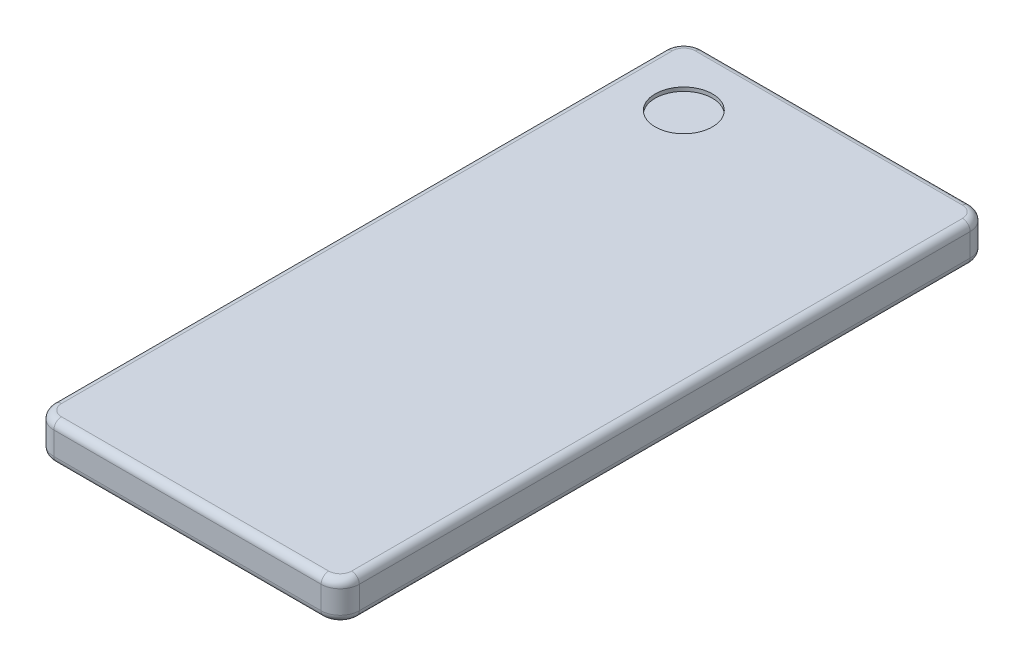
ISO-10303-21;
HEADER;
FILE_DESCRIPTION(('STEP AP214'),'2;1');
FILE_NAME('part.step','',(''),(''),'','','');
FILE_SCHEMA(('AUTOMOTIVE_DESIGN { 1 0 10303 214 1 1 1 1 }'));
ENDSEC;
DATA;
#1=APPLICATION_CONTEXT('core data for automotive mechanical design processes');
#2=APPLICATION_PROTOCOL_DEFINITION('international standard','automotive_design',2000,#1);
#3=PRODUCT_CONTEXT('',#1,'mechanical');
#4=PRODUCT('Part','Part','',(#3));
#5=PRODUCT_RELATED_PRODUCT_CATEGORY('part','',(#4));
#6=PRODUCT_DEFINITION_FORMATION('','',#4);
#7=PRODUCT_DEFINITION_CONTEXT('part definition',#1,'design');
#8=PRODUCT_DEFINITION('design','',#6,#7);
#9=PRODUCT_DEFINITION_SHAPE('','',#8);
#10=(LENGTH_UNIT() NAMED_UNIT(*) SI_UNIT(.MILLI.,.METRE.));
#11=(NAMED_UNIT(*) PLANE_ANGLE_UNIT() SI_UNIT($,.RADIAN.));
#12=(NAMED_UNIT(*) SI_UNIT($,.STERADIAN.) SOLID_ANGLE_UNIT());
#13=UNCERTAINTY_MEASURE_WITH_UNIT(LENGTH_MEASURE(1.E-05),#10,'distance_accuracy_value','');
#14=(GEOMETRIC_REPRESENTATION_CONTEXT(3) GLOBAL_UNCERTAINTY_ASSIGNED_CONTEXT((#13)) GLOBAL_UNIT_ASSIGNED_CONTEXT((#10,
#11,#12)) REPRESENTATION_CONTEXT('',''));
#15=CARTESIAN_POINT('',(0.,0.,0.));
#16=DIRECTION('',(0.,0.,1.));
#17=DIRECTION('',(1.,0.,0.));
#18=AXIS2_PLACEMENT_3D('',#15,#16,#17);
#19=CARTESIAN_POINT('',(40.,10.,-85.));
#20=DIRECTION('',(-1.,0.,0.));
#21=DIRECTION('',(0.,0.,1.));
#22=AXIS2_PLACEMENT_3D('',#19,#20,#21);
#23=PLANE('',#22);
#24=DIRECTION('',(0.,-1.,0.));
#25=VECTOR('',#24,1.);
#26=CARTESIAN_POINT('',(40.,10.,80.));
#27=LINE('',#26,#25);
#28=CARTESIAN_POINT('',(40.,8.,80.));
#29=VERTEX_POINT('',#28);
#30=CARTESIAN_POINT('',(40.,2.,80.));
#31=VERTEX_POINT('',#30);
#32=EDGE_CURVE('E293',#29,#31,#27,.T.);
#33=ORIENTED_EDGE('',*,*,#32,.T.);
#34=DIRECTION('',(0.,0.,-1.));
#35=VECTOR('',#34,1.);
#36=CARTESIAN_POINT('',(40.,2.,-85.));
#37=LINE('',#36,#35);
#38=CARTESIAN_POINT('',(40.,2.,-80.));
#39=VERTEX_POINT('',#38);
#40=EDGE_CURVE('E219',#31,#39,#37,.T.);
#41=ORIENTED_EDGE('',*,*,#40,.T.);
#42=DIRECTION('',(0.,-1.,0.));
#43=VECTOR('',#42,1.);
#44=CARTESIAN_POINT('',(40.,10.,-80.));
#45=LINE('',#44,#43);
#46=CARTESIAN_POINT('',(40.,8.,-80.));
#47=VERTEX_POINT('',#46);
#48=EDGE_CURVE('E304',#39,#47,#45,.F.);
#49=ORIENTED_EDGE('',*,*,#48,.T.);
#50=DIRECTION('',(0.,0.,-1.));
#51=VECTOR('',#50,1.);
#52=CARTESIAN_POINT('',(40.,8.,80.));
#53=LINE('',#52,#51);
#54=EDGE_CURVE('E217',#47,#29,#53,.F.);
#55=ORIENTED_EDGE('',*,*,#54,.T.);
#56=EDGE_LOOP('',(#33,#41,#49,#55));
#57=FACE_BOUND('',#56,.T.);
#58=ADVANCED_FACE('F38',(#57),#23,.F.);
#59=CARTESIAN_POINT('',(-40.,10.,-85.));
#60=DIRECTION('',(0.,0.,1.));
#61=DIRECTION('',(1.,0.,0.));
#62=AXIS2_PLACEMENT_3D('',#59,#60,#61);
#63=PLANE('',#62);
#64=DIRECTION('',(0.,-1.,0.));
#65=VECTOR('',#64,1.);
#66=CARTESIAN_POINT('',(35.,10.,-85.));
#67=LINE('',#66,#65);
#68=CARTESIAN_POINT('',(35.,8.,-85.));
#69=VERTEX_POINT('',#68);
#70=CARTESIAN_POINT('',(35.,2.,-85.));
#71=VERTEX_POINT('',#70);
#72=EDGE_CURVE('E308',#69,#71,#67,.T.);
#73=ORIENTED_EDGE('',*,*,#72,.T.);
#74=DIRECTION('',(-1.,0.,0.));
#75=VECTOR('',#74,1.);
#76=CARTESIAN_POINT('',(-40.,2.,-85.));
#77=LINE('',#76,#75);
#78=CARTESIAN_POINT('',(-35.,2.,-85.));
#79=VERTEX_POINT('',#78);
#80=EDGE_CURVE('E211',#71,#79,#77,.T.);
#81=ORIENTED_EDGE('',*,*,#80,.T.);
#82=DIRECTION('',(0.,-1.,0.));
#83=VECTOR('',#82,1.);
#84=CARTESIAN_POINT('',(-35.,10.,-85.));
#85=LINE('',#84,#83);
#86=CARTESIAN_POINT('',(-35.,8.,-85.));
#87=VERTEX_POINT('',#86);
#88=EDGE_CURVE('E254',#79,#87,#85,.F.);
#89=ORIENTED_EDGE('',*,*,#88,.T.);
#90=DIRECTION('',(-1.,0.,0.));
#91=VECTOR('',#90,1.);
#92=CARTESIAN_POINT('',(35.,8.,-85.));
#93=LINE('',#92,#91);
#94=EDGE_CURVE('E209',#87,#69,#93,.F.);
#95=ORIENTED_EDGE('',*,*,#94,.T.);
#96=EDGE_LOOP('',(#73,#81,#89,#95));
#97=FACE_BOUND('',#96,.T.);
#98=ADVANCED_FACE('F340',(#97),#63,.F.);
#99=CARTESIAN_POINT('',(-40.,10.,-85.));
#100=DIRECTION('',(1.,0.,0.));
#101=DIRECTION('',(0.,0.,-1.));
#102=AXIS2_PLACEMENT_3D('',#99,#100,#101);
#103=PLANE('',#102);
#104=DIRECTION('',(0.,-1.,0.));
#105=VECTOR('',#104,1.);
#106=CARTESIAN_POINT('',(-40.,10.,-80.));
#107=LINE('',#106,#105);
#108=CARTESIAN_POINT('',(-40.,8.,-80.));
#109=VERTEX_POINT('',#108);
#110=CARTESIAN_POINT('',(-40.,2.,-80.));
#111=VERTEX_POINT('',#110);
#112=EDGE_CURVE('E297',#109,#111,#107,.T.);
#113=ORIENTED_EDGE('',*,*,#112,.T.);
#114=DIRECTION('',(0.,0.,1.));
#115=VECTOR('',#114,1.);
#116=CARTESIAN_POINT('',(-40.,2.,-85.));
#117=LINE('',#116,#115);
#118=CARTESIAN_POINT('',(-40.,2.,80.));
#119=VERTEX_POINT('',#118);
#120=EDGE_CURVE('E202',#111,#119,#117,.T.);
#121=ORIENTED_EDGE('',*,*,#120,.T.);
#122=DIRECTION('',(0.,-1.,0.));
#123=VECTOR('',#122,1.);
#124=CARTESIAN_POINT('',(-40.,10.,80.));
#125=LINE('',#124,#123);
#126=CARTESIAN_POINT('',(-40.,8.,80.));
#127=VERTEX_POINT('',#126);
#128=EDGE_CURVE('E299',#119,#127,#125,.F.);
#129=ORIENTED_EDGE('',*,*,#128,.T.);
#130=DIRECTION('',(0.,0.,1.));
#131=VECTOR('',#130,1.);
#132=CARTESIAN_POINT('',(-40.,8.,-80.));
#133=LINE('',#132,#131);
#134=EDGE_CURVE('E200',#127,#109,#133,.F.);
#135=ORIENTED_EDGE('',*,*,#134,.T.);
#136=EDGE_LOOP('',(#113,#121,#129,#135));
#137=FACE_BOUND('',#136,.T.);
#138=ADVANCED_FACE('F337',(#137),#103,.F.);
#139=CARTESIAN_POINT('',(-40.,10.,85.));
#140=DIRECTION('',(0.,0.,-1.));
#141=DIRECTION('',(-1.,0.,0.));
#142=AXIS2_PLACEMENT_3D('',#139,#140,#141);
#143=PLANE('',#142);
#144=DIRECTION('',(0.,-1.,0.));
#145=VECTOR('',#144,1.);
#146=CARTESIAN_POINT('',(35.,10.,85.));
#147=LINE('',#146,#145);
#148=CARTESIAN_POINT('',(35.,2.,85.));
#149=VERTEX_POINT('',#148);
#150=CARTESIAN_POINT('',(35.,8.,85.));
#151=VERTEX_POINT('',#150);
#152=EDGE_CURVE('E180',#149,#151,#147,.F.);
#153=ORIENTED_EDGE('',*,*,#152,.T.);
#154=DIRECTION('',(1.,0.,0.));
#155=VECTOR('',#154,1.);
#156=CARTESIAN_POINT('',(-35.,8.,85.));
#157=LINE('',#156,#155);
#158=CARTESIAN_POINT('',(-35.,8.,85.));
#159=VERTEX_POINT('',#158);
#160=EDGE_CURVE('E11',#151,#159,#157,.F.);
#161=ORIENTED_EDGE('',*,*,#160,.T.);
#162=DIRECTION('',(0.,-1.,0.));
#163=VECTOR('',#162,1.);
#164=CARTESIAN_POINT('',(-35.,10.,85.));
#165=LINE('',#164,#163);
#166=CARTESIAN_POINT('',(-35.,2.,85.));
#167=VERTEX_POINT('',#166);
#168=EDGE_CURVE('E177',#159,#167,#165,.T.);
#169=ORIENTED_EDGE('',*,*,#168,.T.);
#170=DIRECTION('',(1.,0.,0.));
#171=VECTOR('',#170,1.);
#172=CARTESIAN_POINT('',(-40.,2.,85.));
#173=LINE('',#172,#171);
#174=EDGE_CURVE('E47',#167,#149,#173,.T.);
#175=ORIENTED_EDGE('',*,*,#174,.T.);
#176=EDGE_LOOP('',(#153,#161,#169,#175));
#177=FACE_BOUND('',#176,.T.);
#178=ADVANCED_FACE('F295',(#177),#143,.F.);
#179=CARTESIAN_POINT('',(0.,10.,0.));
#180=DIRECTION('',(0.,1.,0.));
#181=DIRECTION('',(0.,0.,1.));
#182=AXIS2_PLACEMENT_3D('',#179,#180,#181);
#183=PLANE('',#182);
#184=CARTESIAN_POINT('',(-23.,10.,-68.));
#185=DIRECTION('',(0.,1.,0.));
#186=DIRECTION('',(0.,0.,1.));
#187=AXIS2_PLACEMENT_3D('',#184,#185,#186);
#188=CIRCLE('',#187,7.5);
#189=CARTESIAN_POINT('',(-23.,10.,-60.5));
#190=VERTEX_POINT('',#189);
#191=EDGE_CURVE('E313',#190,#190,#188,.T.);
#192=ORIENTED_EDGE('',*,*,#191,.F.);
#193=EDGE_LOOP('',(#192));
#194=FACE_BOUND('',#193,.T.);
#195=DIRECTION('',(-1.,0.,0.));
#196=VECTOR('',#195,1.);
#197=CARTESIAN_POINT('',(-35.,10.,-83.));
#198=LINE('',#197,#196);
#199=CARTESIAN_POINT('',(35.,10.,-83.));
#200=VERTEX_POINT('',#199);
#201=CARTESIAN_POINT('',(-35.,10.,-83.));
#202=VERTEX_POINT('',#201);
#203=EDGE_CURVE('E55',#200,#202,#198,.T.);
#204=ORIENTED_EDGE('',*,*,#203,.T.);
#205=CARTESIAN_POINT('',(-35.,10.,-80.));
#206=DIRECTION('',(0.,1.,0.));
#207=DIRECTION('',(0.,0.,1.));
#208=AXIS2_PLACEMENT_3D('',#205,#206,#207);
#209=CIRCLE('',#208,3.);
#210=CARTESIAN_POINT('',(-38.,10.,-80.));
#211=VERTEX_POINT('',#210);
#212=EDGE_CURVE('E236',#202,#211,#209,.T.);
#213=ORIENTED_EDGE('',*,*,#212,.T.);
#214=DIRECTION('',(0.,0.,1.));
#215=VECTOR('',#214,1.);
#216=CARTESIAN_POINT('',(-38.,10.,80.));
#217=LINE('',#216,#215);
#218=CARTESIAN_POINT('',(-38.,10.,80.));
#219=VERTEX_POINT('',#218);
#220=EDGE_CURVE('E224',#211,#219,#217,.T.);
#221=ORIENTED_EDGE('',*,*,#220,.T.);
#222=CARTESIAN_POINT('',(-35.,10.,80.));
#223=DIRECTION('',(0.,1.,0.));
#224=DIRECTION('',(0.,0.,1.));
#225=AXIS2_PLACEMENT_3D('',#222,#223,#224);
#226=CIRCLE('',#225,3.);
#227=CARTESIAN_POINT('',(-35.,10.,83.));
#228=VERTEX_POINT('',#227);
#229=EDGE_CURVE('E226',#219,#228,#226,.T.);
#230=ORIENTED_EDGE('',*,*,#229,.T.);
#231=DIRECTION('',(1.,0.,0.));
#232=VECTOR('',#231,1.);
#233=CARTESIAN_POINT('',(35.,10.,83.));
#234=LINE('',#233,#232);
#235=CARTESIAN_POINT('',(35.,10.,83.));
#236=VERTEX_POINT('',#235);
#237=EDGE_CURVE('E228',#228,#236,#234,.T.);
#238=ORIENTED_EDGE('',*,*,#237,.T.);
#239=CARTESIAN_POINT('',(35.,10.,80.));
#240=DIRECTION('',(0.,1.,0.));
#241=DIRECTION('',(0.,0.,1.));
#242=AXIS2_PLACEMENT_3D('',#239,#240,#241);
#243=CIRCLE('',#242,3.);
#244=CARTESIAN_POINT('',(38.,10.,80.));
#245=VERTEX_POINT('',#244);
#246=EDGE_CURVE('E230',#236,#245,#243,.T.);
#247=ORIENTED_EDGE('',*,*,#246,.T.);
#248=DIRECTION('',(0.,0.,-1.));
#249=VECTOR('',#248,1.);
#250=CARTESIAN_POINT('',(38.,10.,-80.));
#251=LINE('',#250,#249);
#252=CARTESIAN_POINT('',(38.,10.,-80.));
#253=VERTEX_POINT('',#252);
#254=EDGE_CURVE('E232',#245,#253,#251,.T.);
#255=ORIENTED_EDGE('',*,*,#254,.T.);
#256=CARTESIAN_POINT('',(35.,10.,-80.));
#257=DIRECTION('',(0.,1.,0.));
#258=DIRECTION('',(0.,0.,1.));
#259=AXIS2_PLACEMENT_3D('',#256,#257,#258);
#260=CIRCLE('',#259,3.);
#261=EDGE_CURVE('E60',#253,#200,#260,.T.);
#262=ORIENTED_EDGE('',*,*,#261,.T.);
#263=EDGE_LOOP('',(#204,#213,#221,#230,#238,#247,#255,#262));
#264=FACE_BOUND('',#263,.T.);
#265=ADVANCED_FACE('F328',(#194,#264),#183,.T.);
#266=CARTESIAN_POINT('',(0.,0.,0.));
#267=DIRECTION('',(0.,1.,0.));
#268=DIRECTION('',(0.,0.,1.));
#269=AXIS2_PLACEMENT_3D('',#266,#267,#268);
#270=PLANE('',#269);
#271=DIRECTION('',(1.,0.,0.));
#272=VECTOR('',#271,1.);
#273=CARTESIAN_POINT('',(0.,0.,83.));
#274=LINE('',#273,#272);
#275=CARTESIAN_POINT('',(35.,0.,83.));
#276=VERTEX_POINT('',#275);
#277=CARTESIAN_POINT('',(-35.,0.,83.));
#278=VERTEX_POINT('',#277);
#279=EDGE_CURVE('E156',#276,#278,#274,.F.);
#280=ORIENTED_EDGE('',*,*,#279,.T.);
#281=CARTESIAN_POINT('',(-35.,0.,80.));
#282=DIRECTION('',(0.,1.,0.));
#283=DIRECTION('',(0.,0.,1.));
#284=AXIS2_PLACEMENT_3D('',#281,#282,#283);
#285=CIRCLE('',#284,3.);
#286=CARTESIAN_POINT('',(-38.,0.,80.));
#287=VERTEX_POINT('',#286);
#288=EDGE_CURVE('E193',#278,#287,#285,.F.);
#289=ORIENTED_EDGE('',*,*,#288,.T.);
#290=DIRECTION('',(0.,0.,1.));
#291=VECTOR('',#290,1.);
#292=CARTESIAN_POINT('',(-38.,0.,0.));
#293=LINE('',#292,#291);
#294=CARTESIAN_POINT('',(-38.,0.,-80.));
#295=VERTEX_POINT('',#294);
#296=EDGE_CURVE('E191',#287,#295,#293,.F.);
#297=ORIENTED_EDGE('',*,*,#296,.T.);
#298=CARTESIAN_POINT('',(-35.,0.,-80.));
#299=DIRECTION('',(0.,1.,0.));
#300=DIRECTION('',(0.,0.,1.));
#301=AXIS2_PLACEMENT_3D('',#298,#299,#300);
#302=CIRCLE('',#301,3.);
#303=CARTESIAN_POINT('',(-35.,0.,-83.));
#304=VERTEX_POINT('',#303);
#305=EDGE_CURVE('E189',#295,#304,#302,.F.);
#306=ORIENTED_EDGE('',*,*,#305,.T.);
#307=DIRECTION('',(-1.,0.,0.));
#308=VECTOR('',#307,1.);
#309=CARTESIAN_POINT('',(0.,0.,-83.));
#310=LINE('',#309,#308);
#311=CARTESIAN_POINT('',(35.,0.,-83.));
#312=VERTEX_POINT('',#311);
#313=EDGE_CURVE('E187',#304,#312,#310,.F.);
#314=ORIENTED_EDGE('',*,*,#313,.T.);
#315=CARTESIAN_POINT('',(35.,0.,-80.));
#316=DIRECTION('',(0.,1.,0.));
#317=DIRECTION('',(0.,0.,1.));
#318=AXIS2_PLACEMENT_3D('',#315,#316,#317);
#319=CIRCLE('',#318,3.);
#320=CARTESIAN_POINT('',(38.,0.,-80.));
#321=VERTEX_POINT('',#320);
#322=EDGE_CURVE('E185',#312,#321,#319,.F.);
#323=ORIENTED_EDGE('',*,*,#322,.T.);
#324=DIRECTION('',(0.,0.,-1.));
#325=VECTOR('',#324,1.);
#326=CARTESIAN_POINT('',(38.,0.,0.));
#327=LINE('',#326,#325);
#328=CARTESIAN_POINT('',(38.,0.,80.));
#329=VERTEX_POINT('',#328);
#330=EDGE_CURVE('E159',#321,#329,#327,.F.);
#331=ORIENTED_EDGE('',*,*,#330,.T.);
#332=CARTESIAN_POINT('',(35.,0.,80.));
#333=DIRECTION('',(0.,1.,0.));
#334=DIRECTION('',(0.,0.,1.));
#335=AXIS2_PLACEMENT_3D('',#332,#333,#334);
#336=CIRCLE('',#335,3.);
#337=EDGE_CURVE('E151',#329,#276,#336,.F.);
#338=ORIENTED_EDGE('',*,*,#337,.T.);
#339=EDGE_LOOP('',(#280,#289,#297,#306,#314,#323,#331,#338));
#340=FACE_BOUND('',#339,.T.);
#341=ADVANCED_FACE('F153',(#340),#270,.F.);
#342=CARTESIAN_POINT('',(35.,10.,-80.));
#343=DIRECTION('',(0.,-1.,0.));
#344=DIRECTION('',(0.,0.,-1.));
#345=AXIS2_PLACEMENT_3D('',#342,#343,#344);
#346=CYLINDRICAL_SURFACE('',#345,5.);
#347=ORIENTED_EDGE('',*,*,#48,.F.);
#348=CARTESIAN_POINT('',(35.,2.,-80.));
#349=DIRECTION('',(0.,1.,0.));
#350=DIRECTION('',(0.,0.,1.));
#351=AXIS2_PLACEMENT_3D('',#348,#349,#350);
#352=CIRCLE('',#351,5.);
#353=EDGE_CURVE('E215',#39,#71,#352,.T.);
#354=ORIENTED_EDGE('',*,*,#353,.T.);
#355=ORIENTED_EDGE('',*,*,#72,.F.);
#356=CARTESIAN_POINT('',(35.,8.,-80.));
#357=DIRECTION('',(0.,1.,0.));
#358=DIRECTION('',(0.,0.,1.));
#359=AXIS2_PLACEMENT_3D('',#356,#357,#358);
#360=CIRCLE('',#359,5.);
#361=EDGE_CURVE('E213',#69,#47,#360,.F.);
#362=ORIENTED_EDGE('',*,*,#361,.T.);
#363=EDGE_LOOP('',(#347,#354,#355,#362));
#364=FACE_BOUND('',#363,.T.);
#365=ADVANCED_FACE('F335',(#364),#346,.T.);
#366=CARTESIAN_POINT('',(-35.,10.,-80.));
#367=DIRECTION('',(0.,-1.,0.));
#368=DIRECTION('',(0.,0.,-1.));
#369=AXIS2_PLACEMENT_3D('',#366,#367,#368);
#370=CYLINDRICAL_SURFACE('',#369,5.);
#371=ORIENTED_EDGE('',*,*,#88,.F.);
#372=CARTESIAN_POINT('',(-35.,2.,-80.));
#373=DIRECTION('',(0.,1.,0.));
#374=DIRECTION('',(0.,0.,1.));
#375=AXIS2_PLACEMENT_3D('',#372,#373,#374);
#376=CIRCLE('',#375,5.);
#377=EDGE_CURVE('E207',#79,#111,#376,.T.);
#378=ORIENTED_EDGE('',*,*,#377,.T.);
#379=ORIENTED_EDGE('',*,*,#112,.F.);
#380=CARTESIAN_POINT('',(-35.,8.,-80.));
#381=DIRECTION('',(0.,1.,0.));
#382=DIRECTION('',(0.,0.,1.));
#383=AXIS2_PLACEMENT_3D('',#380,#381,#382);
#384=CIRCLE('',#383,5.);
#385=EDGE_CURVE('E204',#109,#87,#384,.F.);
#386=ORIENTED_EDGE('',*,*,#385,.T.);
#387=EDGE_LOOP('',(#371,#378,#379,#386));
#388=FACE_BOUND('',#387,.T.);
#389=ADVANCED_FACE('F352',(#388),#370,.T.);
#390=CARTESIAN_POINT('',(-35.,10.,80.));
#391=DIRECTION('',(0.,-1.,0.));
#392=DIRECTION('',(0.,0.,-1.));
#393=AXIS2_PLACEMENT_3D('',#390,#391,#392);
#394=CYLINDRICAL_SURFACE('',#393,5.);
#395=ORIENTED_EDGE('',*,*,#128,.F.);
#396=CARTESIAN_POINT('',(-35.,2.,80.));
#397=DIRECTION('',(0.,1.,0.));
#398=DIRECTION('',(0.,0.,1.));
#399=AXIS2_PLACEMENT_3D('',#396,#397,#398);
#400=CIRCLE('',#399,5.);
#401=EDGE_CURVE('E197',#119,#167,#400,.T.);
#402=ORIENTED_EDGE('',*,*,#401,.T.);
#403=ORIENTED_EDGE('',*,*,#168,.F.);
#404=CARTESIAN_POINT('',(-35.,8.,80.));
#405=DIRECTION('',(0.,1.,0.));
#406=DIRECTION('',(0.,0.,1.));
#407=AXIS2_PLACEMENT_3D('',#404,#405,#406);
#408=CIRCLE('',#407,5.);
#409=EDGE_CURVE('E195',#159,#127,#408,.F.);
#410=ORIENTED_EDGE('',*,*,#409,.T.);
#411=EDGE_LOOP('',(#395,#402,#403,#410));
#412=FACE_BOUND('',#411,.T.);
#413=ADVANCED_FACE('F356',(#412),#394,.T.);
#414=CARTESIAN_POINT('',(35.,10.,80.));
#415=DIRECTION('',(0.,-1.,0.));
#416=DIRECTION('',(0.,0.,-1.));
#417=AXIS2_PLACEMENT_3D('',#414,#415,#416);
#418=CYLINDRICAL_SURFACE('',#417,5.);
#419=ORIENTED_EDGE('',*,*,#152,.F.);
#420=CARTESIAN_POINT('',(35.,2.,80.));
#421=DIRECTION('',(0.,1.,0.));
#422=DIRECTION('',(0.,0.,1.));
#423=AXIS2_PLACEMENT_3D('',#420,#421,#422);
#424=CIRCLE('',#423,5.);
#425=EDGE_CURVE('E168',#149,#31,#424,.T.);
#426=ORIENTED_EDGE('',*,*,#425,.T.);
#427=ORIENTED_EDGE('',*,*,#32,.F.);
#428=CARTESIAN_POINT('',(35.,8.,80.));
#429=DIRECTION('',(0.,1.,0.));
#430=DIRECTION('',(0.,0.,1.));
#431=AXIS2_PLACEMENT_3D('',#428,#429,#430);
#432=CIRCLE('',#431,5.);
#433=EDGE_CURVE('E221',#29,#151,#432,.F.);
#434=ORIENTED_EDGE('',*,*,#433,.T.);
#435=EDGE_LOOP('',(#419,#426,#427,#434));
#436=FACE_BOUND('',#435,.T.);
#437=ADVANCED_FACE('F291',(#436),#418,.T.);
#438=CARTESIAN_POINT('',(35.,2.,-80.));
#439=DIRECTION('',(0.,1.,0.));
#440=DIRECTION('',(0.,0.,1.));
#441=AXIS2_PLACEMENT_3D('',#438,#439,#440);
#442=TOROIDAL_SURFACE('',#441,3.,2.);
#443=CARTESIAN_POINT('',(35.,2.,-83.));
#444=DIRECTION('',(-1.,0.,0.));
#445=DIRECTION('',(0.,0.,1.));
#446=AXIS2_PLACEMENT_3D('',#443,#444,#445);
#447=CIRCLE('',#446,2.);
#448=EDGE_CURVE('E248',#71,#312,#447,.T.);
#449=ORIENTED_EDGE('',*,*,#448,.F.);
#450=ORIENTED_EDGE('',*,*,#353,.F.);
#451=CARTESIAN_POINT('',(38.,2.,-80.));
#452=DIRECTION('',(0.,0.,1.));
#453=DIRECTION('',(1.,0.,0.));
#454=AXIS2_PLACEMENT_3D('',#451,#452,#453);
#455=CIRCLE('',#454,2.);
#456=EDGE_CURVE('E251',#321,#39,#455,.T.);
#457=ORIENTED_EDGE('',*,*,#456,.F.);
#458=ORIENTED_EDGE('',*,*,#322,.F.);
#459=EDGE_LOOP('',(#449,#450,#457,#458));
#460=FACE_BOUND('',#459,.T.);
#461=ADVANCED_FACE('F363',(#460),#442,.T.);
#462=CARTESIAN_POINT('',(38.,2.,-85.));
#463=DIRECTION('',(0.,0.,-1.));
#464=DIRECTION('',(-1.,0.,0.));
#465=AXIS2_PLACEMENT_3D('',#462,#463,#464);
#466=CYLINDRICAL_SURFACE('',#465,2.);
#467=ORIENTED_EDGE('',*,*,#456,.T.);
#468=ORIENTED_EDGE('',*,*,#40,.F.);
#469=CARTESIAN_POINT('',(38.,2.,80.));
#470=DIRECTION('',(0.,0.,1.));
#471=DIRECTION('',(1.,0.,0.));
#472=AXIS2_PLACEMENT_3D('',#469,#470,#471);
#473=CIRCLE('',#472,2.);
#474=EDGE_CURVE('E246',#329,#31,#473,.T.);
#475=ORIENTED_EDGE('',*,*,#474,.F.);
#476=ORIENTED_EDGE('',*,*,#330,.F.);
#477=EDGE_LOOP('',(#467,#468,#475,#476));
#478=FACE_BOUND('',#477,.T.);
#479=ADVANCED_FACE('F383',(#478),#466,.T.);
#480=CARTESIAN_POINT('',(-40.,2.,-83.));
#481=DIRECTION('',(-1.,0.,0.));
#482=DIRECTION('',(0.,0.,1.));
#483=AXIS2_PLACEMENT_3D('',#480,#481,#482);
#484=CYLINDRICAL_SURFACE('',#483,2.);
#485=ORIENTED_EDGE('',*,*,#448,.T.);
#486=ORIENTED_EDGE('',*,*,#313,.F.);
#487=CARTESIAN_POINT('',(-35.,2.,-83.));
#488=DIRECTION('',(-1.,0.,0.));
#489=DIRECTION('',(0.,0.,1.));
#490=AXIS2_PLACEMENT_3D('',#487,#488,#489);
#491=CIRCLE('',#490,2.);
#492=EDGE_CURVE('E171',#79,#304,#491,.T.);
#493=ORIENTED_EDGE('',*,*,#492,.F.);
#494=ORIENTED_EDGE('',*,*,#80,.F.);
#495=EDGE_LOOP('',(#485,#486,#493,#494));
#496=FACE_BOUND('',#495,.T.);
#497=ADVANCED_FACE('F380',(#496),#484,.T.);
#498=CARTESIAN_POINT('',(35.,2.,80.));
#499=DIRECTION('',(0.,1.,0.));
#500=DIRECTION('',(0.,0.,1.));
#501=AXIS2_PLACEMENT_3D('',#498,#499,#500);
#502=TOROIDAL_SURFACE('',#501,3.,2.);
#503=ORIENTED_EDGE('',*,*,#474,.T.);
#504=ORIENTED_EDGE('',*,*,#425,.F.);
#505=CARTESIAN_POINT('',(35.,2.,83.));
#506=DIRECTION('',(-1.,0.,0.));
#507=DIRECTION('',(0.,0.,1.));
#508=AXIS2_PLACEMENT_3D('',#505,#506,#507);
#509=CIRCLE('',#508,2.);
#510=EDGE_CURVE('E166',#276,#149,#509,.T.);
#511=ORIENTED_EDGE('',*,*,#510,.F.);
#512=ORIENTED_EDGE('',*,*,#337,.F.);
#513=EDGE_LOOP('',(#503,#504,#511,#512));
#514=FACE_BOUND('',#513,.T.);
#515=ADVANCED_FACE('F167',(#514),#502,.T.);
#516=CARTESIAN_POINT('',(-35.,2.,-80.));
#517=DIRECTION('',(0.,1.,0.));
#518=DIRECTION('',(0.,0.,1.));
#519=AXIS2_PLACEMENT_3D('',#516,#517,#518);
#520=TOROIDAL_SURFACE('',#519,3.,2.);
#521=ORIENTED_EDGE('',*,*,#492,.T.);
#522=ORIENTED_EDGE('',*,*,#305,.F.);
#523=CARTESIAN_POINT('',(-38.,2.,-80.));
#524=DIRECTION('',(0.,0.,1.));
#525=DIRECTION('',(1.,0.,0.));
#526=AXIS2_PLACEMENT_3D('',#523,#524,#525);
#527=CIRCLE('',#526,2.);
#528=EDGE_CURVE('E172',#111,#295,#527,.T.);
#529=ORIENTED_EDGE('',*,*,#528,.F.);
#530=ORIENTED_EDGE('',*,*,#377,.F.);
#531=EDGE_LOOP('',(#521,#522,#529,#530));
#532=FACE_BOUND('',#531,.T.);
#533=ADVANCED_FACE('F374',(#532),#520,.T.);
#534=CARTESIAN_POINT('',(-40.,2.,83.));
#535=DIRECTION('',(1.,0.,0.));
#536=DIRECTION('',(0.,0.,-1.));
#537=AXIS2_PLACEMENT_3D('',#534,#535,#536);
#538=CYLINDRICAL_SURFACE('',#537,2.);
#539=ORIENTED_EDGE('',*,*,#510,.T.);
#540=ORIENTED_EDGE('',*,*,#174,.F.);
#541=CARTESIAN_POINT('',(-35.,2.,83.));
#542=DIRECTION('',(-1.,0.,0.));
#543=DIRECTION('',(0.,0.,1.));
#544=AXIS2_PLACEMENT_3D('',#541,#542,#543);
#545=CIRCLE('',#544,2.);
#546=EDGE_CURVE('E175',#278,#167,#545,.T.);
#547=ORIENTED_EDGE('',*,*,#546,.F.);
#548=ORIENTED_EDGE('',*,*,#279,.F.);
#549=EDGE_LOOP('',(#539,#540,#547,#548));
#550=FACE_BOUND('',#549,.T.);
#551=ADVANCED_FACE('F174',(#550),#538,.T.);
#552=CARTESIAN_POINT('',(-38.,2.,-85.));
#553=DIRECTION('',(0.,0.,1.));
#554=DIRECTION('',(1.,0.,0.));
#555=AXIS2_PLACEMENT_3D('',#552,#553,#554);
#556=CYLINDRICAL_SURFACE('',#555,2.);
#557=ORIENTED_EDGE('',*,*,#528,.T.);
#558=ORIENTED_EDGE('',*,*,#296,.F.);
#559=CARTESIAN_POINT('',(-38.,2.,80.));
#560=DIRECTION('',(0.,0.,1.));
#561=DIRECTION('',(1.,0.,0.));
#562=AXIS2_PLACEMENT_3D('',#559,#560,#561);
#563=CIRCLE('',#562,2.);
#564=EDGE_CURVE('E239',#119,#287,#563,.T.);
#565=ORIENTED_EDGE('',*,*,#564,.F.);
#566=ORIENTED_EDGE('',*,*,#120,.F.);
#567=EDGE_LOOP('',(#557,#558,#565,#566));
#568=FACE_BOUND('',#567,.T.);
#569=ADVANCED_FACE('F367',(#568),#556,.T.);
#570=CARTESIAN_POINT('',(-35.,2.,80.));
#571=DIRECTION('',(0.,1.,0.));
#572=DIRECTION('',(0.,0.,1.));
#573=AXIS2_PLACEMENT_3D('',#570,#571,#572);
#574=TOROIDAL_SURFACE('',#573,3.,2.);
#575=ORIENTED_EDGE('',*,*,#546,.T.);
#576=ORIENTED_EDGE('',*,*,#401,.F.);
#577=ORIENTED_EDGE('',*,*,#564,.T.);
#578=ORIENTED_EDGE('',*,*,#288,.F.);
#579=EDGE_LOOP('',(#575,#576,#577,#578));
#580=FACE_BOUND('',#579,.T.);
#581=ADVANCED_FACE('F364',(#580),#574,.T.);
#582=CARTESIAN_POINT('',(35.,8.,80.));
#583=DIRECTION('',(0.,1.,0.));
#584=DIRECTION('',(0.,0.,1.));
#585=AXIS2_PLACEMENT_3D('',#582,#583,#584);
#586=TOROIDAL_SURFACE('',#585,3.,2.);
#587=CARTESIAN_POINT('',(35.,8.,83.));
#588=DIRECTION('',(-1.,0.,0.));
#589=DIRECTION('',(0.,0.,1.));
#590=AXIS2_PLACEMENT_3D('',#587,#588,#589);
#591=CIRCLE('',#590,2.);
#592=EDGE_CURVE('E271',#151,#236,#591,.T.);
#593=ORIENTED_EDGE('',*,*,#592,.F.);
#594=ORIENTED_EDGE('',*,*,#433,.F.);
#595=CARTESIAN_POINT('',(38.,8.,80.));
#596=DIRECTION('',(0.,0.,-1.));
#597=DIRECTION('',(-1.,0.,0.));
#598=AXIS2_PLACEMENT_3D('',#595,#596,#597);
#599=CIRCLE('',#598,2.);
#600=EDGE_CURVE('E42',#245,#29,#599,.T.);
#601=ORIENTED_EDGE('',*,*,#600,.F.);
#602=ORIENTED_EDGE('',*,*,#246,.F.);
#603=EDGE_LOOP('',(#593,#594,#601,#602));
#604=FACE_BOUND('',#603,.T.);
#605=ADVANCED_FACE('F40',(#604),#586,.T.);
#606=CARTESIAN_POINT('',(38.,8.,0.));
#607=DIRECTION('',(0.,0.,1.));
#608=DIRECTION('',(1.,0.,0.));
#609=AXIS2_PLACEMENT_3D('',#606,#607,#608);
#610=CYLINDRICAL_SURFACE('',#609,2.);
#611=ORIENTED_EDGE('',*,*,#600,.T.);
#612=ORIENTED_EDGE('',*,*,#54,.F.);
#613=CARTESIAN_POINT('',(38.,8.,-80.));
#614=DIRECTION('',(0.,0.,-1.));
#615=DIRECTION('',(-1.,0.,0.));
#616=AXIS2_PLACEMENT_3D('',#613,#614,#615);
#617=CIRCLE('',#616,2.);
#618=EDGE_CURVE('E269',#253,#47,#617,.T.);
#619=ORIENTED_EDGE('',*,*,#618,.F.);
#620=ORIENTED_EDGE('',*,*,#254,.F.);
#621=EDGE_LOOP('',(#611,#612,#619,#620));
#622=FACE_BOUND('',#621,.T.);
#623=ADVANCED_FACE('F282',(#622),#610,.T.);
#624=CARTESIAN_POINT('',(0.,8.,83.));
#625=DIRECTION('',(-1.,0.,0.));
#626=DIRECTION('',(0.,0.,1.));
#627=AXIS2_PLACEMENT_3D('',#624,#625,#626);
#628=CYLINDRICAL_SURFACE('',#627,2.);
#629=ORIENTED_EDGE('',*,*,#592,.T.);
#630=ORIENTED_EDGE('',*,*,#237,.F.);
#631=CARTESIAN_POINT('',(-35.,8.,83.));
#632=DIRECTION('',(-1.,0.,0.));
#633=DIRECTION('',(0.,0.,1.));
#634=AXIS2_PLACEMENT_3D('',#631,#632,#633);
#635=CIRCLE('',#634,2.);
#636=EDGE_CURVE('E266',#159,#228,#635,.T.);
#637=ORIENTED_EDGE('',*,*,#636,.F.);
#638=ORIENTED_EDGE('',*,*,#160,.F.);
#639=EDGE_LOOP('',(#629,#630,#637,#638));
#640=FACE_BOUND('',#639,.T.);
#641=ADVANCED_FACE('F409',(#640),#628,.T.);
#642=CARTESIAN_POINT('',(35.,8.,-80.));
#643=DIRECTION('',(0.,1.,0.));
#644=DIRECTION('',(0.,0.,1.));
#645=AXIS2_PLACEMENT_3D('',#642,#643,#644);
#646=TOROIDAL_SURFACE('',#645,3.,2.);
#647=ORIENTED_EDGE('',*,*,#618,.T.);
#648=ORIENTED_EDGE('',*,*,#361,.F.);
#649=CARTESIAN_POINT('',(35.,8.,-83.));
#650=DIRECTION('',(-1.,0.,0.));
#651=DIRECTION('',(0.,0.,1.));
#652=AXIS2_PLACEMENT_3D('',#649,#650,#651);
#653=CIRCLE('',#652,2.);
#654=EDGE_CURVE('E263',#200,#69,#653,.T.);
#655=ORIENTED_EDGE('',*,*,#654,.F.);
#656=ORIENTED_EDGE('',*,*,#261,.F.);
#657=EDGE_LOOP('',(#647,#648,#655,#656));
#658=FACE_BOUND('',#657,.T.);
#659=ADVANCED_FACE('F405',(#658),#646,.T.);
#660=CARTESIAN_POINT('',(-35.,8.,80.));
#661=DIRECTION('',(0.,1.,0.));
#662=DIRECTION('',(0.,0.,1.));
#663=AXIS2_PLACEMENT_3D('',#660,#661,#662);
#664=TOROIDAL_SURFACE('',#663,3.,2.);
#665=ORIENTED_EDGE('',*,*,#636,.T.);
#666=ORIENTED_EDGE('',*,*,#229,.F.);
#667=CARTESIAN_POINT('',(-38.,8.,80.));
#668=DIRECTION('',(0.,0.,-1.));
#669=DIRECTION('',(-1.,0.,0.));
#670=AXIS2_PLACEMENT_3D('',#667,#668,#669);
#671=CIRCLE('',#670,2.);
#672=EDGE_CURVE('E260',#127,#219,#671,.T.);
#673=ORIENTED_EDGE('',*,*,#672,.F.);
#674=ORIENTED_EDGE('',*,*,#409,.F.);
#675=EDGE_LOOP('',(#665,#666,#673,#674));
#676=FACE_BOUND('',#675,.T.);
#677=ADVANCED_FACE('F401',(#676),#664,.T.);
#678=CARTESIAN_POINT('',(0.,8.,-83.));
#679=DIRECTION('',(1.,0.,0.));
#680=DIRECTION('',(0.,0.,-1.));
#681=AXIS2_PLACEMENT_3D('',#678,#679,#680);
#682=CYLINDRICAL_SURFACE('',#681,2.);
#683=ORIENTED_EDGE('',*,*,#654,.T.);
#684=ORIENTED_EDGE('',*,*,#94,.F.);
#685=CARTESIAN_POINT('',(-35.,8.,-83.));
#686=DIRECTION('',(-1.,0.,0.));
#687=DIRECTION('',(0.,0.,1.));
#688=AXIS2_PLACEMENT_3D('',#685,#686,#687);
#689=CIRCLE('',#688,2.);
#690=EDGE_CURVE('E257',#202,#87,#689,.T.);
#691=ORIENTED_EDGE('',*,*,#690,.F.);
#692=ORIENTED_EDGE('',*,*,#203,.F.);
#693=EDGE_LOOP('',(#683,#684,#691,#692));
#694=FACE_BOUND('',#693,.T.);
#695=ADVANCED_FACE('F397',(#694),#682,.T.);
#696=CARTESIAN_POINT('',(-38.,8.,0.));
#697=DIRECTION('',(0.,0.,-1.));
#698=DIRECTION('',(-1.,0.,0.));
#699=AXIS2_PLACEMENT_3D('',#696,#697,#698);
#700=CYLINDRICAL_SURFACE('',#699,2.);
#701=ORIENTED_EDGE('',*,*,#672,.T.);
#702=ORIENTED_EDGE('',*,*,#220,.F.);
#703=CARTESIAN_POINT('',(-38.,8.,-80.));
#704=DIRECTION('',(0.,0.,-1.));
#705=DIRECTION('',(-1.,0.,0.));
#706=AXIS2_PLACEMENT_3D('',#703,#704,#705);
#707=CIRCLE('',#706,2.);
#708=EDGE_CURVE('E255',#109,#211,#707,.T.);
#709=ORIENTED_EDGE('',*,*,#708,.F.);
#710=ORIENTED_EDGE('',*,*,#134,.F.);
#711=EDGE_LOOP('',(#701,#702,#709,#710));
#712=FACE_BOUND('',#711,.T.);
#713=ADVANCED_FACE('F393',(#712),#700,.T.);
#714=CARTESIAN_POINT('',(-35.,8.,-80.));
#715=DIRECTION('',(0.,1.,0.));
#716=DIRECTION('',(0.,0.,1.));
#717=AXIS2_PLACEMENT_3D('',#714,#715,#716);
#718=TOROIDAL_SURFACE('',#717,3.,2.);
#719=ORIENTED_EDGE('',*,*,#690,.T.);
#720=ORIENTED_EDGE('',*,*,#385,.F.);
#721=ORIENTED_EDGE('',*,*,#708,.T.);
#722=ORIENTED_EDGE('',*,*,#212,.F.);
#723=EDGE_LOOP('',(#719,#720,#721,#722));
#724=FACE_BOUND('',#723,.T.);
#725=ADVANCED_FACE('F324',(#724),#718,.T.);
#726=CARTESIAN_POINT('',(-23.,9.,-68.));
#727=DIRECTION('',(0.,1.,0.));
#728=DIRECTION('',(0.,0.,1.));
#729=AXIS2_PLACEMENT_3D('',#726,#727,#728);
#730=CYLINDRICAL_SURFACE('',#729,7.5);
#731=CARTESIAN_POINT('',(-23.,9.,-68.));
#732=DIRECTION('',(0.,1.,0.));
#733=DIRECTION('',(0.,0.,1.));
#734=AXIS2_PLACEMENT_3D('',#731,#732,#733);
#735=CIRCLE('',#734,7.5);
#736=CARTESIAN_POINT('',(-23.,9.,-60.5));
#737=VERTEX_POINT('',#736);
#738=EDGE_CURVE('E258',#737,#737,#735,.T.);
#739=ORIENTED_EDGE('',*,*,#738,.F.);
#740=EDGE_LOOP('',(#739));
#741=FACE_BOUND('',#740,.T.);
#742=ORIENTED_EDGE('',*,*,#191,.T.);
#743=EDGE_LOOP('',(#742));
#744=FACE_BOUND('',#743,.T.);
#745=ADVANCED_FACE('F321',(#741,#744),#730,.F.);
#746=CARTESIAN_POINT('',(-23.,9.,-68.));
#747=DIRECTION('',(0.,1.,0.));
#748=DIRECTION('',(0.,0.,1.));
#749=AXIS2_PLACEMENT_3D('',#746,#747,#748);
#750=PLANE('',#749);
#751=ORIENTED_EDGE('',*,*,#738,.T.);
#752=EDGE_LOOP('',(#751));
#753=FACE_BOUND('',#752,.T.);
#754=ADVANCED_FACE('F319',(#753),#750,.T.);
#755=CLOSED_SHELL('',(#58,#98,#138,#178,#265,#341,#365,#389,#413,#437,#461,#479,#497,#515,#533,
#551,#569,#581,#605,#623,#641,#659,#677,#695,#713,#725,#745,#754));
#756=MANIFOLD_SOLID_BREP('B2',#755);
#757=ADVANCED_BREP_SHAPE_REPRESENTATION('',(#18,#756),#14);
#758=SHAPE_DEFINITION_REPRESENTATION(#9,#757);
ENDSEC;
END-ISO-10303-21;
